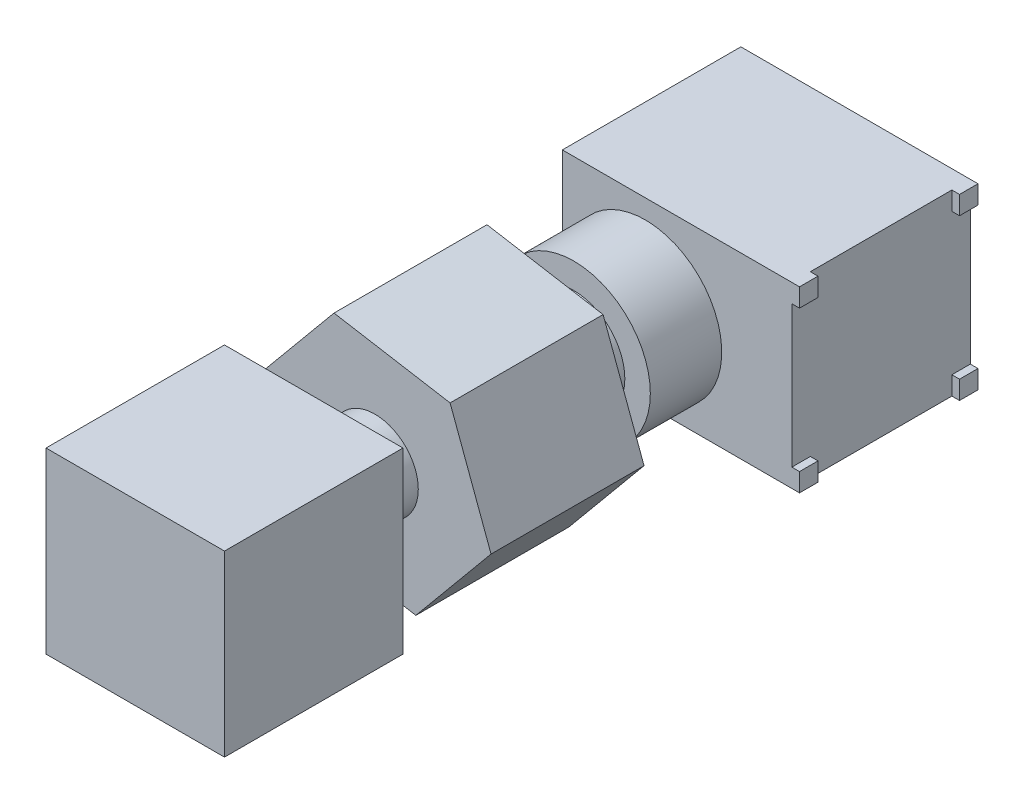
ISO-10303-21;
HEADER;
FILE_DESCRIPTION(('STEP AP214'),'2;1');
FILE_NAME('part.step','',(''),(''),'','','');
FILE_SCHEMA(('AUTOMOTIVE_DESIGN { 1 0 10303 214 1 1 1 1 }'));
ENDSEC;
DATA;
#1=APPLICATION_CONTEXT('core data for automotive mechanical design processes');
#2=APPLICATION_PROTOCOL_DEFINITION('international standard','automotive_design',2000,#1);
#3=PRODUCT_CONTEXT('',#1,'mechanical');
#4=PRODUCT('Part','Part','',(#3));
#5=PRODUCT_RELATED_PRODUCT_CATEGORY('part','',(#4));
#6=PRODUCT_DEFINITION_FORMATION('','',#4);
#7=PRODUCT_DEFINITION_CONTEXT('part definition',#1,'design');
#8=PRODUCT_DEFINITION('design','',#6,#7);
#9=PRODUCT_DEFINITION_SHAPE('','',#8);
#10=(LENGTH_UNIT() NAMED_UNIT(*) SI_UNIT(.MILLI.,.METRE.));
#11=(NAMED_UNIT(*) PLANE_ANGLE_UNIT() SI_UNIT($,.RADIAN.));
#12=(NAMED_UNIT(*) SI_UNIT($,.STERADIAN.) SOLID_ANGLE_UNIT());
#13=UNCERTAINTY_MEASURE_WITH_UNIT(LENGTH_MEASURE(1.E-05),#10,'distance_accuracy_value','');
#14=(GEOMETRIC_REPRESENTATION_CONTEXT(3) GLOBAL_UNCERTAINTY_ASSIGNED_CONTEXT((#13)) GLOBAL_UNIT_ASSIGNED_CONTEXT((#10,
#11,#12)) REPRESENTATION_CONTEXT('',''));
#15=CARTESIAN_POINT('',(0.,0.,0.));
#16=DIRECTION('',(0.,0.,1.));
#17=DIRECTION('',(1.,0.,0.));
#18=AXIS2_PLACEMENT_3D('',#15,#16,#17);
#19=CARTESIAN_POINT('',(0.,0.,14.1));
#20=DIRECTION('',(0.,0.,1.));
#21=DIRECTION('',(1.,0.,0.));
#22=AXIS2_PLACEMENT_3D('',#19,#20,#21);
#23=PLANE('',#22);
#24=DIRECTION('',(-0.34758878852976,0.937647073310856,0.));
#25=VECTOR('',#24,1.);
#26=CARTESIAN_POINT('',(3.30331021574324,2.47495199339549,14.1));
#27=LINE('',#26,#25);
#28=CARTESIAN_POINT('',(3.30331021574324,2.47495199339549,14.1));
#29=VERTEX_POINT('',#28);
#30=CARTESIAN_POINT('',(1.69786637074361,6.80575831484259,14.1));
#31=VERTEX_POINT('',#30);
#32=EDGE_CURVE('E245',#29,#31,#27,.T.);
#33=ORIENTED_EDGE('',*,*,#32,.T.);
#34=DIRECTION('',(-0.985820579536211,0.167802815717999,0.));
#35=VECTOR('',#34,1.);
#36=CARTESIAN_POINT('',(1.69786637074361,6.80575831484259,14.1));
#37=LINE('',#36,#35);
#38=CARTESIAN_POINT('',(-2.85544384499962,7.5808063214471,14.1));
#39=VERTEX_POINT('',#38);
#40=EDGE_CURVE('E248',#31,#39,#37,.T.);
#41=ORIENTED_EDGE('',*,*,#40,.T.);
#42=DIRECTION('',(-0.638231791006451,-0.769844257592857,0.));
#43=VECTOR('',#42,1.);
#44=CARTESIAN_POINT('',(-2.85544384499962,7.5808063214471,14.1));
#45=LINE('',#44,#43);
#46=CARTESIAN_POINT('',(-5.80331021574323,4.02504800660451,14.1));
#47=VERTEX_POINT('',#46);
#48=EDGE_CURVE('E251',#39,#47,#45,.T.);
#49=ORIENTED_EDGE('',*,*,#48,.T.);
#50=DIRECTION('',(0.34758878852976,-0.937647073310856,0.));
#51=VECTOR('',#50,1.);
#52=CARTESIAN_POINT('',(-5.80331021574323,4.02504800660451,14.1));
#53=LINE('',#52,#51);
#54=CARTESIAN_POINT('',(-4.19786637074361,-0.305758314842589,14.1));
#55=VERTEX_POINT('',#54);
#56=EDGE_CURVE('E253',#47,#55,#53,.T.);
#57=ORIENTED_EDGE('',*,*,#56,.T.);
#58=DIRECTION('',(0.985820579536211,-0.167802815717999,0.));
#59=VECTOR('',#58,1.);
#60=CARTESIAN_POINT('',(-4.19786637074361,-0.305758314842589,14.1));
#61=LINE('',#60,#59);
#62=CARTESIAN_POINT('',(0.355443844999625,-1.0808063214471,14.1));
#63=VERTEX_POINT('',#62);
#64=EDGE_CURVE('E255',#55,#63,#61,.T.);
#65=ORIENTED_EDGE('',*,*,#64,.T.);
#66=DIRECTION('',(0.638231791006451,0.769844257592857,0.));
#67=VECTOR('',#66,1.);
#68=CARTESIAN_POINT('',(0.355443844999625,-1.0808063214471,14.1));
#69=LINE('',#68,#67);
#70=EDGE_CURVE('E257',#63,#29,#69,.T.);
#71=ORIENTED_EDGE('',*,*,#70,.T.);
#72=EDGE_LOOP('',(#33,#41,#49,#57,#65,#71));
#73=FACE_BOUND('',#72,.T.);
#74=CARTESIAN_POINT('',(-1.25,3.25,14.1));
#75=DIRECTION('',(0.,0.,1.));
#76=DIRECTION('',(1.,0.,0.));
#77=AXIS2_PLACEMENT_3D('',#74,#75,#76);
#78=CIRCLE('',#77,1.7);
#79=CARTESIAN_POINT('',(0.450000000000003,3.25,14.1));
#80=VERTEX_POINT('',#79);
#81=EDGE_CURVE('E233',#80,#80,#78,.T.);
#82=ORIENTED_EDGE('',*,*,#81,.F.);
#83=EDGE_LOOP('',(#82));
#84=FACE_BOUND('',#83,.T.);
#85=ADVANCED_FACE('F36',(#73,#84),#23,.T.);
#86=CARTESIAN_POINT('',(-1.25,3.25,6.3));
#87=DIRECTION('',(0.,0.,1.));
#88=DIRECTION('',(1.,0.,0.));
#89=AXIS2_PLACEMENT_3D('',#86,#87,#88);
#90=PLANE('',#89);
#91=CARTESIAN_POINT('',(-1.25,3.25,6.3));
#92=DIRECTION('',(0.,0.,1.));
#93=DIRECTION('',(1.,0.,0.));
#94=AXIS2_PLACEMENT_3D('',#91,#92,#93);
#95=CIRCLE('',#94,3.);
#96=CARTESIAN_POINT('',(1.75,3.25,6.3));
#97=VERTEX_POINT('',#96);
#98=EDGE_CURVE('E292',#97,#97,#95,.T.);
#99=ORIENTED_EDGE('',*,*,#98,.T.);
#100=EDGE_LOOP('',(#99));
#101=FACE_BOUND('',#100,.T.);
#102=CARTESIAN_POINT('',(-1.25,3.25,6.3));
#103=DIRECTION('',(0.,0.,1.));
#104=DIRECTION('',(1.,0.,0.));
#105=AXIS2_PLACEMENT_3D('',#102,#103,#104);
#106=CIRCLE('',#105,2.);
#107=CARTESIAN_POINT('',(0.750000000000001,3.25,6.3));
#108=VERTEX_POINT('',#107);
#109=EDGE_CURVE('E288',#108,#108,#106,.T.);
#110=ORIENTED_EDGE('',*,*,#109,.F.);
#111=EDGE_LOOP('',(#110));
#112=FACE_BOUND('',#111,.T.);
#113=ADVANCED_FACE('F495',(#101,#112),#90,.T.);
#114=CARTESIAN_POINT('',(-4.5,7.,3.5));
#115=DIRECTION('',(0.,0.,-1.));
#116=DIRECTION('',(-1.,0.,0.));
#117=AXIS2_PLACEMENT_3D('',#114,#115,#116);
#118=PLANE('',#117);
#119=DIRECTION('',(1.,0.,0.));
#120=VECTOR('',#119,1.);
#121=CARTESIAN_POINT('',(-4.5,0.,3.5));
#122=LINE('',#121,#120);
#123=CARTESIAN_POINT('',(-4.5,0.,3.5));
#124=VERTEX_POINT('',#123);
#125=CARTESIAN_POINT('',(4.8,0.,3.5));
#126=VERTEX_POINT('',#125);
#127=EDGE_CURVE('E418',#124,#126,#122,.T.);
#128=ORIENTED_EDGE('',*,*,#127,.T.);
#129=DIRECTION('',(0.,-1.,0.));
#130=VECTOR('',#129,1.);
#131=CARTESIAN_POINT('',(4.8,0.,3.5));
#132=LINE('',#131,#130);
#133=CARTESIAN_POINT('',(4.8,0.725,3.5));
#134=VERTEX_POINT('',#133);
#135=EDGE_CURVE('E319',#134,#126,#132,.T.);
#136=ORIENTED_EDGE('',*,*,#135,.F.);
#137=DIRECTION('',(-1.,0.,0.));
#138=VECTOR('',#137,1.);
#139=CARTESIAN_POINT('',(4.8,0.725,3.5));
#140=LINE('',#139,#138);
#141=CARTESIAN_POINT('',(4.5,0.725,3.5));
#142=VERTEX_POINT('',#141);
#143=EDGE_CURVE('E329',#134,#142,#140,.T.);
#144=ORIENTED_EDGE('',*,*,#143,.T.);
#145=DIRECTION('',(0.,-1.,0.));
#146=VECTOR('',#145,1.);
#147=CARTESIAN_POINT('',(4.5,7.,3.5));
#148=LINE('',#147,#146);
#149=CARTESIAN_POINT('',(4.5,6.275,3.5));
#150=VERTEX_POINT('',#149);
#151=EDGE_CURVE('E408',#150,#142,#148,.T.);
#152=ORIENTED_EDGE('',*,*,#151,.F.);
#153=DIRECTION('',(-1.,0.,0.));
#154=VECTOR('',#153,1.);
#155=CARTESIAN_POINT('',(4.8,6.275,3.5));
#156=LINE('',#155,#154);
#157=CARTESIAN_POINT('',(4.8,6.275,3.5));
#158=VERTEX_POINT('',#157);
#159=EDGE_CURVE('E393',#158,#150,#156,.T.);
#160=ORIENTED_EDGE('',*,*,#159,.F.);
#161=DIRECTION('',(0.,-1.,0.));
#162=VECTOR('',#161,1.);
#163=CARTESIAN_POINT('',(4.8,7.,3.5));
#164=LINE('',#163,#162);
#165=CARTESIAN_POINT('',(4.8,7.,3.5));
#166=VERTEX_POINT('',#165);
#167=EDGE_CURVE('E364',#166,#158,#164,.T.);
#168=ORIENTED_EDGE('',*,*,#167,.F.);
#169=DIRECTION('',(1.,0.,0.));
#170=VECTOR('',#169,1.);
#171=CARTESIAN_POINT('',(-4.5,7.,3.5));
#172=LINE('',#171,#170);
#173=CARTESIAN_POINT('',(-4.5,7.,3.5));
#174=VERTEX_POINT('',#173);
#175=EDGE_CURVE('E412',#174,#166,#172,.T.);
#176=ORIENTED_EDGE('',*,*,#175,.F.);
#177=DIRECTION('',(0.,-1.,0.));
#178=VECTOR('',#177,1.);
#179=CARTESIAN_POINT('',(-4.5,7.,3.5));
#180=LINE('',#179,#178);
#181=EDGE_CURVE('E411',#174,#124,#180,.T.);
#182=ORIENTED_EDGE('',*,*,#181,.T.);
#183=EDGE_LOOP('',(#128,#136,#144,#152,#160,#168,#176,#182));
#184=FACE_BOUND('',#183,.T.);
#185=CARTESIAN_POINT('',(-1.25,3.25,3.5));
#186=DIRECTION('',(0.,0.,-1.));
#187=DIRECTION('',(-1.,0.,0.));
#188=AXIS2_PLACEMENT_3D('',#185,#186,#187);
#189=CIRCLE('',#188,3.);
#190=CARTESIAN_POINT('',(-4.25,3.25,3.5));
#191=VERTEX_POINT('',#190);
#192=EDGE_CURVE('E11',#191,#191,#189,.F.);
#193=ORIENTED_EDGE('',*,*,#192,.F.);
#194=EDGE_LOOP('',(#193));
#195=FACE_BOUND('',#194,.T.);
#196=ADVANCED_FACE('F467',(#184,#195),#118,.F.);
#197=CARTESIAN_POINT('',(4.5,7.,-3.5));
#198=DIRECTION('',(-1.,0.,0.));
#199=DIRECTION('',(0.,0.,1.));
#200=AXIS2_PLACEMENT_3D('',#197,#198,#199);
#201=PLANE('',#200);
#202=DIRECTION('',(0.,0.,1.));
#203=VECTOR('',#202,1.);
#204=CARTESIAN_POINT('',(4.5,0.725,-3.5));
#205=LINE('',#204,#203);
#206=CARTESIAN_POINT('',(4.5,0.725,-3.5));
#207=VERTEX_POINT('',#206);
#208=CARTESIAN_POINT('',(4.5,0.725,-2.775));
#209=VERTEX_POINT('',#208);
#210=EDGE_CURVE('E55',#207,#209,#205,.T.);
#211=ORIENTED_EDGE('',*,*,#210,.F.);
#212=DIRECTION('',(0.,-1.,0.));
#213=VECTOR('',#212,1.);
#214=CARTESIAN_POINT('',(4.5,7.,-3.5));
#215=LINE('',#214,#213);
#216=CARTESIAN_POINT('',(4.5,6.275,-3.5));
#217=VERTEX_POINT('',#216);
#218=EDGE_CURVE('E44',#217,#207,#215,.T.);
#219=ORIENTED_EDGE('',*,*,#218,.F.);
#220=DIRECTION('',(0.,0.,-1.));
#221=VECTOR('',#220,1.);
#222=CARTESIAN_POINT('',(4.5,6.275,-3.5));
#223=LINE('',#222,#221);
#224=CARTESIAN_POINT('',(4.5,6.275,-2.775));
#225=VERTEX_POINT('',#224);
#226=EDGE_CURVE('E347',#225,#217,#223,.T.);
#227=ORIENTED_EDGE('',*,*,#226,.F.);
#228=DIRECTION('',(0.,-1.,0.));
#229=VECTOR('',#228,1.);
#230=CARTESIAN_POINT('',(4.5,7.,-2.775));
#231=LINE('',#230,#229);
#232=CARTESIAN_POINT('',(4.5,7.,-2.775));
#233=VERTEX_POINT('',#232);
#234=EDGE_CURVE('E342',#233,#225,#231,.T.);
#235=ORIENTED_EDGE('',*,*,#234,.F.);
#236=DIRECTION('',(0.,0.,-1.));
#237=VECTOR('',#236,1.);
#238=CARTESIAN_POINT('',(4.5,7.,-3.5));
#239=LINE('',#238,#237);
#240=CARTESIAN_POINT('',(4.5,7.,2.775));
#241=VERTEX_POINT('',#240);
#242=EDGE_CURVE('E413',#241,#233,#239,.T.);
#243=ORIENTED_EDGE('',*,*,#242,.F.);
#244=DIRECTION('',(0.,1.,0.));
#245=VECTOR('',#244,1.);
#246=CARTESIAN_POINT('',(4.5,7.,2.775));
#247=LINE('',#246,#245);
#248=CARTESIAN_POINT('',(4.5,6.275,2.775));
#249=VERTEX_POINT('',#248);
#250=EDGE_CURVE('E368',#249,#241,#247,.T.);
#251=ORIENTED_EDGE('',*,*,#250,.F.);
#252=DIRECTION('',(0.,0.,-1.));
#253=VECTOR('',#252,1.);
#254=CARTESIAN_POINT('',(4.5,6.275,3.5));
#255=LINE('',#254,#253);
#256=EDGE_CURVE('E363',#150,#249,#255,.T.);
#257=ORIENTED_EDGE('',*,*,#256,.F.);
#258=ORIENTED_EDGE('',*,*,#151,.T.);
#259=DIRECTION('',(0.,0.,1.));
#260=VECTOR('',#259,1.);
#261=CARTESIAN_POINT('',(4.5,0.725,3.5));
#262=LINE('',#261,#260);
#263=CARTESIAN_POINT('',(4.5,0.725,2.775));
#264=VERTEX_POINT('',#263);
#265=EDGE_CURVE('E323',#264,#142,#262,.T.);
#266=ORIENTED_EDGE('',*,*,#265,.F.);
#267=DIRECTION('',(0.,1.,0.));
#268=VECTOR('',#267,1.);
#269=CARTESIAN_POINT('',(4.5,0.,2.775));
#270=LINE('',#269,#268);
#271=CARTESIAN_POINT('',(4.5,0.,2.775));
#272=VERTEX_POINT('',#271);
#273=EDGE_CURVE('E318',#272,#264,#270,.T.);
#274=ORIENTED_EDGE('',*,*,#273,.F.);
#275=DIRECTION('',(0.,0.,-1.));
#276=VECTOR('',#275,1.);
#277=CARTESIAN_POINT('',(4.5,0.,-3.5));
#278=LINE('',#277,#276);
#279=CARTESIAN_POINT('',(4.5,0.,-2.775));
#280=VERTEX_POINT('',#279);
#281=EDGE_CURVE('E398',#272,#280,#278,.T.);
#282=ORIENTED_EDGE('',*,*,#281,.T.);
#283=DIRECTION('',(0.,-1.,0.));
#284=VECTOR('',#283,1.);
#285=CARTESIAN_POINT('',(4.5,0.,-2.775));
#286=LINE('',#285,#284);
#287=EDGE_CURVE('E51',#209,#280,#286,.T.);
#288=ORIENTED_EDGE('',*,*,#287,.F.);
#289=EDGE_LOOP('',(#211,#219,#227,#235,#243,#251,#257,#258,#266,#274,#282,#288));
#290=FACE_BOUND('',#289,.T.);
#291=ADVANCED_FACE('F38',(#290),#201,.F.);
#292=CARTESIAN_POINT('',(-4.5,7.,-3.5));
#293=DIRECTION('',(0.,0.,1.));
#294=DIRECTION('',(1.,0.,0.));
#295=AXIS2_PLACEMENT_3D('',#292,#293,#294);
#296=PLANE('',#295);
#297=DIRECTION('',(-1.,0.,0.));
#298=VECTOR('',#297,1.);
#299=CARTESIAN_POINT('',(-4.5,0.,-3.5));
#300=LINE('',#299,#298);
#301=CARTESIAN_POINT('',(4.8,0.,-3.5));
#302=VERTEX_POINT('',#301);
#303=CARTESIAN_POINT('',(-4.5,0.,-3.5));
#304=VERTEX_POINT('',#303);
#305=EDGE_CURVE('E402',#302,#304,#300,.T.);
#306=ORIENTED_EDGE('',*,*,#305,.T.);
#307=DIRECTION('',(0.,-1.,0.));
#308=VECTOR('',#307,1.);
#309=CARTESIAN_POINT('',(-4.5,7.,-3.5));
#310=LINE('',#309,#308);
#311=CARTESIAN_POINT('',(-4.5,7.,-3.5));
#312=VERTEX_POINT('',#311);
#313=EDGE_CURVE('E422',#312,#304,#310,.T.);
#314=ORIENTED_EDGE('',*,*,#313,.F.);
#315=DIRECTION('',(-1.,0.,0.));
#316=VECTOR('',#315,1.);
#317=CARTESIAN_POINT('',(-4.5,7.,-3.5));
#318=LINE('',#317,#316);
#319=CARTESIAN_POINT('',(4.8,7.,-3.5));
#320=VERTEX_POINT('',#319);
#321=EDGE_CURVE('E454',#320,#312,#318,.T.);
#322=ORIENTED_EDGE('',*,*,#321,.F.);
#323=DIRECTION('',(0.,1.,0.));
#324=VECTOR('',#323,1.);
#325=CARTESIAN_POINT('',(4.8,7.,-3.5));
#326=LINE('',#325,#324);
#327=CARTESIAN_POINT('',(4.8,6.275,-3.5));
#328=VERTEX_POINT('',#327);
#329=EDGE_CURVE('E343',#328,#320,#326,.T.);
#330=ORIENTED_EDGE('',*,*,#329,.F.);
#331=DIRECTION('',(-1.,0.,0.));
#332=VECTOR('',#331,1.);
#333=CARTESIAN_POINT('',(4.8,6.275,-3.5));
#334=LINE('',#333,#332);
#335=EDGE_CURVE('E353',#328,#217,#334,.T.);
#336=ORIENTED_EDGE('',*,*,#335,.T.);
#337=ORIENTED_EDGE('',*,*,#218,.T.);
#338=DIRECTION('',(-1.,0.,0.));
#339=VECTOR('',#338,1.);
#340=CARTESIAN_POINT('',(4.8,0.725,-3.5));
#341=LINE('',#340,#339);
#342=CARTESIAN_POINT('',(4.8,0.725,-3.5));
#343=VERTEX_POINT('',#342);
#344=EDGE_CURVE('E315',#343,#207,#341,.T.);
#345=ORIENTED_EDGE('',*,*,#344,.F.);
#346=DIRECTION('',(0.,1.,0.));
#347=VECTOR('',#346,1.);
#348=CARTESIAN_POINT('',(4.8,0.,-3.5));
#349=LINE('',#348,#347);
#350=EDGE_CURVE('E297',#302,#343,#349,.T.);
#351=ORIENTED_EDGE('',*,*,#350,.F.);
#352=EDGE_LOOP('',(#306,#314,#322,#330,#336,#337,#345,#351));
#353=FACE_BOUND('',#352,.T.);
#354=ADVANCED_FACE('F426',(#353),#296,.F.);
#355=CARTESIAN_POINT('',(-4.5,7.,-3.5));
#356=DIRECTION('',(1.,0.,0.));
#357=DIRECTION('',(0.,0.,-1.));
#358=AXIS2_PLACEMENT_3D('',#355,#356,#357);
#359=PLANE('',#358);
#360=DIRECTION('',(0.,0.,1.));
#361=VECTOR('',#360,1.);
#362=CARTESIAN_POINT('',(-4.5,0.,-3.5));
#363=LINE('',#362,#361);
#364=EDGE_CURVE('E442',#304,#124,#363,.T.);
#365=ORIENTED_EDGE('',*,*,#364,.T.);
#366=ORIENTED_EDGE('',*,*,#181,.F.);
#367=DIRECTION('',(0.,0.,1.));
#368=VECTOR('',#367,1.);
#369=CARTESIAN_POINT('',(-4.5,7.,-3.5));
#370=LINE('',#369,#368);
#371=EDGE_CURVE('E447',#312,#174,#370,.T.);
#372=ORIENTED_EDGE('',*,*,#371,.F.);
#373=ORIENTED_EDGE('',*,*,#313,.T.);
#374=EDGE_LOOP('',(#365,#366,#372,#373));
#375=FACE_BOUND('',#374,.T.);
#376=ADVANCED_FACE('F445',(#375),#359,.F.);
#377=CARTESIAN_POINT('',(0.,7.,0.));
#378=DIRECTION('',(0.,1.,0.));
#379=DIRECTION('',(0.,0.,1.));
#380=AXIS2_PLACEMENT_3D('',#377,#378,#379);
#381=PLANE('',#380);
#382=ORIENTED_EDGE('',*,*,#175,.T.);
#383=DIRECTION('',(0.,0.,1.));
#384=VECTOR('',#383,1.);
#385=CARTESIAN_POINT('',(4.8,7.,3.5));
#386=LINE('',#385,#384);
#387=CARTESIAN_POINT('',(4.8,7.,2.775));
#388=VERTEX_POINT('',#387);
#389=EDGE_CURVE('E372',#388,#166,#386,.T.);
#390=ORIENTED_EDGE('',*,*,#389,.F.);
#391=DIRECTION('',(-1.,0.,0.));
#392=VECTOR('',#391,1.);
#393=CARTESIAN_POINT('',(4.8,7.,2.775));
#394=LINE('',#393,#392);
#395=EDGE_CURVE('E375',#388,#241,#394,.T.);
#396=ORIENTED_EDGE('',*,*,#395,.T.);
#397=ORIENTED_EDGE('',*,*,#242,.T.);
#398=DIRECTION('',(-1.,0.,0.));
#399=VECTOR('',#398,1.);
#400=CARTESIAN_POINT('',(4.8,7.,-2.775));
#401=LINE('',#400,#399);
#402=CARTESIAN_POINT('',(4.8,7.,-2.775));
#403=VERTEX_POINT('',#402);
#404=EDGE_CURVE('E361',#403,#233,#401,.T.);
#405=ORIENTED_EDGE('',*,*,#404,.F.);
#406=DIRECTION('',(0.,0.,1.));
#407=VECTOR('',#406,1.);
#408=CARTESIAN_POINT('',(4.8,7.,-3.5));
#409=LINE('',#408,#407);
#410=EDGE_CURVE('E346',#320,#403,#409,.T.);
#411=ORIENTED_EDGE('',*,*,#410,.F.);
#412=ORIENTED_EDGE('',*,*,#321,.T.);
#413=ORIENTED_EDGE('',*,*,#371,.T.);
#414=EDGE_LOOP('',(#382,#390,#396,#397,#405,#411,#412,#413));
#415=FACE_BOUND('',#414,.T.);
#416=ADVANCED_FACE('F458',(#415),#381,.T.);
#417=CARTESIAN_POINT('',(0.,0.,0.));
#418=DIRECTION('',(0.,1.,0.));
#419=DIRECTION('',(0.,0.,1.));
#420=AXIS2_PLACEMENT_3D('',#417,#418,#419);
#421=PLANE('',#420);
#422=ORIENTED_EDGE('',*,*,#281,.F.);
#423=DIRECTION('',(-1.,0.,0.));
#424=VECTOR('',#423,1.);
#425=CARTESIAN_POINT('',(4.8,0.,2.775));
#426=LINE('',#425,#424);
#427=CARTESIAN_POINT('',(4.8,0.,2.775));
#428=VERTEX_POINT('',#427);
#429=EDGE_CURVE('E339',#428,#272,#426,.T.);
#430=ORIENTED_EDGE('',*,*,#429,.F.);
#431=DIRECTION('',(0.,0.,-1.));
#432=VECTOR('',#431,1.);
#433=CARTESIAN_POINT('',(4.8,0.,3.5));
#434=LINE('',#433,#432);
#435=EDGE_CURVE('E322',#126,#428,#434,.T.);
#436=ORIENTED_EDGE('',*,*,#435,.F.);
#437=ORIENTED_EDGE('',*,*,#127,.F.);
#438=ORIENTED_EDGE('',*,*,#364,.F.);
#439=ORIENTED_EDGE('',*,*,#305,.F.);
#440=DIRECTION('',(0.,0.,-1.));
#441=VECTOR('',#440,1.);
#442=CARTESIAN_POINT('',(4.8,0.,-3.5));
#443=LINE('',#442,#441);
#444=CARTESIAN_POINT('',(4.8,0.,-2.775));
#445=VERTEX_POINT('',#444);
#446=EDGE_CURVE('E304',#445,#302,#443,.T.);
#447=ORIENTED_EDGE('',*,*,#446,.F.);
#448=DIRECTION('',(-1.,0.,0.));
#449=VECTOR('',#448,1.);
#450=CARTESIAN_POINT('',(4.8,0.,-2.775));
#451=LINE('',#450,#449);
#452=EDGE_CURVE('E307',#445,#280,#451,.T.);
#453=ORIENTED_EDGE('',*,*,#452,.T.);
#454=EDGE_LOOP('',(#422,#430,#436,#437,#438,#439,#447,#453));
#455=FACE_BOUND('',#454,.T.);
#456=ADVANCED_FACE('F449',(#455),#421,.F.);
#457=CARTESIAN_POINT('',(4.8,6.275,3.5));
#458=DIRECTION('',(0.,1.,0.));
#459=DIRECTION('',(0.,0.,1.));
#460=AXIS2_PLACEMENT_3D('',#457,#458,#459);
#461=PLANE('',#460);
#462=ORIENTED_EDGE('',*,*,#256,.T.);
#463=DIRECTION('',(-1.,0.,0.));
#464=VECTOR('',#463,1.);
#465=CARTESIAN_POINT('',(4.8,6.275,2.775));
#466=LINE('',#465,#464);
#467=CARTESIAN_POINT('',(4.8,6.275,2.775));
#468=VERTEX_POINT('',#467);
#469=EDGE_CURVE('E378',#468,#249,#466,.T.);
#470=ORIENTED_EDGE('',*,*,#469,.F.);
#471=DIRECTION('',(0.,0.,-1.));
#472=VECTOR('',#471,1.);
#473=CARTESIAN_POINT('',(4.8,6.275,3.5));
#474=LINE('',#473,#472);
#475=EDGE_CURVE('E367',#158,#468,#474,.T.);
#476=ORIENTED_EDGE('',*,*,#475,.F.);
#477=ORIENTED_EDGE('',*,*,#159,.T.);
#478=EDGE_LOOP('',(#462,#470,#476,#477));
#479=FACE_BOUND('',#478,.T.);
#480=ADVANCED_FACE('F576',(#479),#461,.F.);
#481=CARTESIAN_POINT('',(4.8,7.,2.775));
#482=DIRECTION('',(0.,0.,1.));
#483=DIRECTION('',(1.,0.,0.));
#484=AXIS2_PLACEMENT_3D('',#481,#482,#483);
#485=PLANE('',#484);
#486=ORIENTED_EDGE('',*,*,#250,.T.);
#487=ORIENTED_EDGE('',*,*,#395,.F.);
#488=DIRECTION('',(0.,1.,0.));
#489=VECTOR('',#488,1.);
#490=CARTESIAN_POINT('',(4.8,7.,2.775));
#491=LINE('',#490,#489);
#492=EDGE_CURVE('E370',#468,#388,#491,.T.);
#493=ORIENTED_EDGE('',*,*,#492,.F.);
#494=ORIENTED_EDGE('',*,*,#469,.T.);
#495=EDGE_LOOP('',(#486,#487,#493,#494));
#496=FACE_BOUND('',#495,.T.);
#497=ADVANCED_FACE('F461',(#496),#485,.F.);
#498=CARTESIAN_POINT('',(4.8,0.,0.));
#499=DIRECTION('',(1.,0.,0.));
#500=DIRECTION('',(0.,0.,-1.));
#501=AXIS2_PLACEMENT_3D('',#498,#499,#500);
#502=PLANE('',#501);
#503=ORIENTED_EDGE('',*,*,#167,.T.);
#504=ORIENTED_EDGE('',*,*,#475,.T.);
#505=ORIENTED_EDGE('',*,*,#492,.T.);
#506=ORIENTED_EDGE('',*,*,#389,.T.);
#507=EDGE_LOOP('',(#503,#504,#505,#506));
#508=FACE_BOUND('',#507,.T.);
#509=ADVANCED_FACE('F465',(#508),#502,.T.);
#510=CARTESIAN_POINT('',(4.8,7.,-2.775));
#511=DIRECTION('',(0.,0.,-1.));
#512=DIRECTION('',(-1.,0.,0.));
#513=AXIS2_PLACEMENT_3D('',#510,#511,#512);
#514=PLANE('',#513);
#515=ORIENTED_EDGE('',*,*,#234,.T.);
#516=DIRECTION('',(-1.,0.,0.));
#517=VECTOR('',#516,1.);
#518=CARTESIAN_POINT('',(4.8,6.275,-2.775));
#519=LINE('',#518,#517);
#520=CARTESIAN_POINT('',(4.8,6.275,-2.775));
#521=VERTEX_POINT('',#520);
#522=EDGE_CURVE('E358',#521,#225,#519,.T.);
#523=ORIENTED_EDGE('',*,*,#522,.F.);
#524=DIRECTION('',(0.,-1.,0.));
#525=VECTOR('',#524,1.);
#526=CARTESIAN_POINT('',(4.8,7.,-2.775));
#527=LINE('',#526,#525);
#528=EDGE_CURVE('E349',#403,#521,#527,.T.);
#529=ORIENTED_EDGE('',*,*,#528,.F.);
#530=ORIENTED_EDGE('',*,*,#404,.T.);
#531=EDGE_LOOP('',(#515,#523,#529,#530));
#532=FACE_BOUND('',#531,.T.);
#533=ADVANCED_FACE('F594',(#532),#514,.F.);
#534=CARTESIAN_POINT('',(4.8,6.275,-3.5));
#535=DIRECTION('',(0.,1.,0.));
#536=DIRECTION('',(0.,0.,1.));
#537=AXIS2_PLACEMENT_3D('',#534,#535,#536);
#538=PLANE('',#537);
#539=ORIENTED_EDGE('',*,*,#226,.T.);
#540=ORIENTED_EDGE('',*,*,#335,.F.);
#541=DIRECTION('',(0.,0.,-1.));
#542=VECTOR('',#541,1.);
#543=CARTESIAN_POINT('',(4.8,6.275,-3.5));
#544=LINE('',#543,#542);
#545=EDGE_CURVE('E351',#521,#328,#544,.T.);
#546=ORIENTED_EDGE('',*,*,#545,.F.);
#547=ORIENTED_EDGE('',*,*,#522,.T.);
#548=EDGE_LOOP('',(#539,#540,#546,#547));
#549=FACE_BOUND('',#548,.T.);
#550=ADVANCED_FACE('F601',(#549),#538,.F.);
#551=CARTESIAN_POINT('',(4.8,0.,0.));
#552=DIRECTION('',(-1.,0.,0.));
#553=DIRECTION('',(0.,0.,1.));
#554=AXIS2_PLACEMENT_3D('',#551,#552,#553);
#555=PLANE('',#554);
#556=ORIENTED_EDGE('',*,*,#329,.T.);
#557=ORIENTED_EDGE('',*,*,#410,.T.);
#558=ORIENTED_EDGE('',*,*,#528,.T.);
#559=ORIENTED_EDGE('',*,*,#545,.T.);
#560=EDGE_LOOP('',(#556,#557,#558,#559));
#561=FACE_BOUND('',#560,.T.);
#562=ADVANCED_FACE('F609',(#561),#555,.F.);
#563=CARTESIAN_POINT('',(4.8,0.,2.775));
#564=DIRECTION('',(0.,0.,1.));
#565=DIRECTION('',(1.,0.,0.));
#566=AXIS2_PLACEMENT_3D('',#563,#564,#565);
#567=PLANE('',#566);
#568=ORIENTED_EDGE('',*,*,#273,.T.);
#569=DIRECTION('',(-1.,0.,0.));
#570=VECTOR('',#569,1.);
#571=CARTESIAN_POINT('',(4.8,0.725,2.775));
#572=LINE('',#571,#570);
#573=CARTESIAN_POINT('',(4.8,0.725,2.775));
#574=VERTEX_POINT('',#573);
#575=EDGE_CURVE('E336',#574,#264,#572,.T.);
#576=ORIENTED_EDGE('',*,*,#575,.F.);
#577=DIRECTION('',(0.,1.,0.));
#578=VECTOR('',#577,1.);
#579=CARTESIAN_POINT('',(4.8,0.,2.775));
#580=LINE('',#579,#578);
#581=EDGE_CURVE('E325',#428,#574,#580,.T.);
#582=ORIENTED_EDGE('',*,*,#581,.F.);
#583=ORIENTED_EDGE('',*,*,#429,.T.);
#584=EDGE_LOOP('',(#568,#576,#582,#583));
#585=FACE_BOUND('',#584,.T.);
#586=ADVANCED_FACE('F479',(#585),#567,.F.);
#587=CARTESIAN_POINT('',(4.8,0.725,3.5));
#588=DIRECTION('',(0.,-1.,0.));
#589=DIRECTION('',(0.,0.,-1.));
#590=AXIS2_PLACEMENT_3D('',#587,#588,#589);
#591=PLANE('',#590);
#592=ORIENTED_EDGE('',*,*,#265,.T.);
#593=ORIENTED_EDGE('',*,*,#143,.F.);
#594=DIRECTION('',(0.,0.,1.));
#595=VECTOR('',#594,1.);
#596=CARTESIAN_POINT('',(4.8,0.725,3.5));
#597=LINE('',#596,#595);
#598=EDGE_CURVE('E327',#574,#134,#597,.T.);
#599=ORIENTED_EDGE('',*,*,#598,.F.);
#600=ORIENTED_EDGE('',*,*,#575,.T.);
#601=EDGE_LOOP('',(#592,#593,#599,#600));
#602=FACE_BOUND('',#601,.T.);
#603=ADVANCED_FACE('F474',(#602),#591,.F.);
#604=CARTESIAN_POINT('',(4.8,0.,0.));
#605=DIRECTION('',(-1.,0.,0.));
#606=DIRECTION('',(0.,0.,1.));
#607=AXIS2_PLACEMENT_3D('',#604,#605,#606);
#608=PLANE('',#607);
#609=ORIENTED_EDGE('',*,*,#135,.T.);
#610=ORIENTED_EDGE('',*,*,#435,.T.);
#611=ORIENTED_EDGE('',*,*,#581,.T.);
#612=ORIENTED_EDGE('',*,*,#598,.T.);
#613=EDGE_LOOP('',(#609,#610,#611,#612));
#614=FACE_BOUND('',#613,.T.);
#615=ADVANCED_FACE('F492',(#614),#608,.F.);
#616=CARTESIAN_POINT('',(4.8,0.725,-3.5));
#617=DIRECTION('',(0.,-1.,0.));
#618=DIRECTION('',(0.,0.,-1.));
#619=AXIS2_PLACEMENT_3D('',#616,#617,#618);
#620=PLANE('',#619);
#621=ORIENTED_EDGE('',*,*,#210,.T.);
#622=DIRECTION('',(-1.,0.,0.));
#623=VECTOR('',#622,1.);
#624=CARTESIAN_POINT('',(4.8,0.725,-2.775));
#625=LINE('',#624,#623);
#626=CARTESIAN_POINT('',(4.8,0.725,-2.775));
#627=VERTEX_POINT('',#626);
#628=EDGE_CURVE('E312',#627,#209,#625,.T.);
#629=ORIENTED_EDGE('',*,*,#628,.F.);
#630=DIRECTION('',(0.,0.,1.));
#631=VECTOR('',#630,1.);
#632=CARTESIAN_POINT('',(4.8,0.725,-3.5));
#633=LINE('',#632,#631);
#634=EDGE_CURVE('E300',#343,#627,#633,.T.);
#635=ORIENTED_EDGE('',*,*,#634,.F.);
#636=ORIENTED_EDGE('',*,*,#344,.T.);
#637=EDGE_LOOP('',(#621,#629,#635,#636));
#638=FACE_BOUND('',#637,.T.);
#639=ADVANCED_FACE('F432',(#638),#620,.F.);
#640=CARTESIAN_POINT('',(4.8,0.,-2.775));
#641=DIRECTION('',(0.,0.,-1.));
#642=DIRECTION('',(-1.,0.,0.));
#643=AXIS2_PLACEMENT_3D('',#640,#641,#642);
#644=PLANE('',#643);
#645=ORIENTED_EDGE('',*,*,#287,.T.);
#646=ORIENTED_EDGE('',*,*,#452,.F.);
#647=DIRECTION('',(0.,-1.,0.));
#648=VECTOR('',#647,1.);
#649=CARTESIAN_POINT('',(4.8,0.,-2.775));
#650=LINE('',#649,#648);
#651=EDGE_CURVE('E302',#627,#445,#650,.T.);
#652=ORIENTED_EDGE('',*,*,#651,.F.);
#653=ORIENTED_EDGE('',*,*,#628,.T.);
#654=EDGE_LOOP('',(#645,#646,#652,#653));
#655=FACE_BOUND('',#654,.T.);
#656=ADVANCED_FACE('F483',(#655),#644,.F.);
#657=CARTESIAN_POINT('',(4.8,0.,0.));
#658=DIRECTION('',(1.,0.,0.));
#659=DIRECTION('',(0.,0.,-1.));
#660=AXIS2_PLACEMENT_3D('',#657,#658,#659);
#661=PLANE('',#660);
#662=ORIENTED_EDGE('',*,*,#350,.T.);
#663=ORIENTED_EDGE('',*,*,#634,.T.);
#664=ORIENTED_EDGE('',*,*,#651,.T.);
#665=ORIENTED_EDGE('',*,*,#446,.T.);
#666=EDGE_LOOP('',(#662,#663,#664,#665));
#667=FACE_BOUND('',#666,.T.);
#668=ADVANCED_FACE('F436',(#667),#661,.T.);
#669=CARTESIAN_POINT('',(-1.25,3.25,6.3));
#670=DIRECTION('',(0.,0.,-1.));
#671=DIRECTION('',(-1.,0.,0.));
#672=AXIS2_PLACEMENT_3D('',#669,#670,#671);
#673=CYLINDRICAL_SURFACE('',#672,3.);
#674=ORIENTED_EDGE('',*,*,#98,.F.);
#675=EDGE_LOOP('',(#674));
#676=FACE_BOUND('',#675,.T.);
#677=ORIENTED_EDGE('',*,*,#192,.T.);
#678=EDGE_LOOP('',(#677));
#679=FACE_BOUND('',#678,.T.);
#680=ADVANCED_FACE('F490',(#676,#679),#673,.T.);
#681=CARTESIAN_POINT('',(-1.25,3.25,8.1));
#682=DIRECTION('',(0.,0.,-1.));
#683=DIRECTION('',(-1.,0.,0.));
#684=AXIS2_PLACEMENT_3D('',#681,#682,#683);
#685=CYLINDRICAL_SURFACE('',#684,2.);
#686=CARTESIAN_POINT('',(-1.25,3.25,8.1));
#687=DIRECTION('',(0.,0.,1.));
#688=DIRECTION('',(1.,0.,0.));
#689=AXIS2_PLACEMENT_3D('',#686,#687,#688);
#690=CIRCLE('',#689,2.);
#691=CARTESIAN_POINT('',(0.750000000000001,3.25,8.1));
#692=VERTEX_POINT('',#691);
#693=EDGE_CURVE('E289',#692,#692,#690,.T.);
#694=ORIENTED_EDGE('',*,*,#693,.F.);
#695=EDGE_LOOP('',(#694));
#696=FACE_BOUND('',#695,.T.);
#697=ORIENTED_EDGE('',*,*,#109,.T.);
#698=EDGE_LOOP('',(#697));
#699=FACE_BOUND('',#698,.T.);
#700=ADVANCED_FACE('F512',(#696,#699),#685,.T.);
#701=CARTESIAN_POINT('',(0.,0.,8.1));
#702=DIRECTION('',(0.,0.,1.));
#703=DIRECTION('',(1.,0.,0.));
#704=AXIS2_PLACEMENT_3D('',#701,#702,#703);
#705=PLANE('',#704);
#706=DIRECTION('',(-0.34758878852976,0.937647073310856,0.));
#707=VECTOR('',#706,1.);
#708=CARTESIAN_POINT('',(3.30331021574324,2.47495199339549,8.1));
#709=LINE('',#708,#707);
#710=CARTESIAN_POINT('',(3.30331021574324,2.47495199339549,8.1));
#711=VERTEX_POINT('',#710);
#712=CARTESIAN_POINT('',(1.69786637074361,6.80575831484259,8.1));
#713=VERTEX_POINT('',#712);
#714=EDGE_CURVE('E243',#711,#713,#709,.T.);
#715=ORIENTED_EDGE('',*,*,#714,.F.);
#716=DIRECTION('',(0.638231791006451,0.769844257592857,0.));
#717=VECTOR('',#716,1.);
#718=CARTESIAN_POINT('',(0.355443844999625,-1.0808063214471,8.1));
#719=LINE('',#718,#717);
#720=CARTESIAN_POINT('',(0.355443844999625,-1.0808063214471,8.1));
#721=VERTEX_POINT('',#720);
#722=EDGE_CURVE('E249',#721,#711,#719,.T.);
#723=ORIENTED_EDGE('',*,*,#722,.F.);
#724=DIRECTION('',(0.985820579536211,-0.167802815717999,0.));
#725=VECTOR('',#724,1.);
#726=CARTESIAN_POINT('',(-4.19786637074361,-0.305758314842589,8.1));
#727=LINE('',#726,#725);
#728=CARTESIAN_POINT('',(-4.19786637074361,-0.305758314842589,8.1));
#729=VERTEX_POINT('',#728);
#730=EDGE_CURVE('E268',#729,#721,#727,.T.);
#731=ORIENTED_EDGE('',*,*,#730,.F.);
#732=DIRECTION('',(0.34758878852976,-0.937647073310856,0.));
#733=VECTOR('',#732,1.);
#734=CARTESIAN_POINT('',(-5.80331021574323,4.02504800660451,8.1));
#735=LINE('',#734,#733);
#736=CARTESIAN_POINT('',(-5.80331021574323,4.02504800660451,8.1));
#737=VERTEX_POINT('',#736);
#738=EDGE_CURVE('E266',#737,#729,#735,.T.);
#739=ORIENTED_EDGE('',*,*,#738,.F.);
#740=DIRECTION('',(-0.638231791006451,-0.769844257592857,0.));
#741=VECTOR('',#740,1.);
#742=CARTESIAN_POINT('',(-2.85544384499962,7.5808063214471,8.1));
#743=LINE('',#742,#741);
#744=CARTESIAN_POINT('',(-2.85544384499962,7.5808063214471,8.1));
#745=VERTEX_POINT('',#744);
#746=EDGE_CURVE('E264',#745,#737,#743,.T.);
#747=ORIENTED_EDGE('',*,*,#746,.F.);
#748=DIRECTION('',(-0.985820579536211,0.167802815717999,0.));
#749=VECTOR('',#748,1.);
#750=CARTESIAN_POINT('',(1.69786637074361,6.80575831484259,8.1));
#751=LINE('',#750,#749);
#752=EDGE_CURVE('E262',#713,#745,#751,.T.);
#753=ORIENTED_EDGE('',*,*,#752,.F.);
#754=EDGE_LOOP('',(#715,#723,#731,#739,#747,#753));
#755=FACE_BOUND('',#754,.T.);
#756=ORIENTED_EDGE('',*,*,#693,.T.);
#757=EDGE_LOOP('',(#756));
#758=FACE_BOUND('',#757,.T.);
#759=ADVANCED_FACE('F508',(#755,#758),#705,.F.);
#760=CARTESIAN_POINT('',(3.30331021574324,2.47495199339549,14.1));
#761=DIRECTION('',(-0.937647073310856,-0.34758878852976,0.));
#762=DIRECTION('',(0.34758878852976,-0.937647073310856,0.));
#763=AXIS2_PLACEMENT_3D('',#760,#761,#762);
#764=PLANE('',#763);
#765=ORIENTED_EDGE('',*,*,#714,.T.);
#766=DIRECTION('',(0.,0.,-1.));
#767=VECTOR('',#766,1.);
#768=CARTESIAN_POINT('',(1.69786637074361,6.80575831484259,14.1));
#769=LINE('',#768,#767);
#770=EDGE_CURVE('E285',#31,#713,#769,.T.);
#771=ORIENTED_EDGE('',*,*,#770,.F.);
#772=ORIENTED_EDGE('',*,*,#32,.F.);
#773=DIRECTION('',(0.,0.,-1.));
#774=VECTOR('',#773,1.);
#775=CARTESIAN_POINT('',(3.30331021574324,2.47495199339549,14.1));
#776=LINE('',#775,#774);
#777=EDGE_CURVE('E259',#29,#711,#776,.T.);
#778=ORIENTED_EDGE('',*,*,#777,.T.);
#779=EDGE_LOOP('',(#765,#771,#772,#778));
#780=FACE_BOUND('',#779,.T.);
#781=ADVANCED_FACE('F511',(#780),#764,.F.);
#782=CARTESIAN_POINT('',(1.69786637074361,6.80575831484259,14.1));
#783=DIRECTION('',(-0.167802815717999,-0.985820579536211,0.));
#784=DIRECTION('',(0.985820579536211,-0.167802815717999,0.));
#785=AXIS2_PLACEMENT_3D('',#782,#783,#784);
#786=PLANE('',#785);
#787=ORIENTED_EDGE('',*,*,#752,.T.);
#788=DIRECTION('',(0.,0.,-1.));
#789=VECTOR('',#788,1.);
#790=CARTESIAN_POINT('',(-2.85544384499962,7.5808063214471,14.1));
#791=LINE('',#790,#789);
#792=EDGE_CURVE('E282',#39,#745,#791,.T.);
#793=ORIENTED_EDGE('',*,*,#792,.F.);
#794=ORIENTED_EDGE('',*,*,#40,.F.);
#795=ORIENTED_EDGE('',*,*,#770,.T.);
#796=EDGE_LOOP('',(#787,#793,#794,#795));
#797=FACE_BOUND('',#796,.T.);
#798=ADVANCED_FACE('F529',(#797),#786,.F.);
#799=CARTESIAN_POINT('',(-2.85544384499962,7.5808063214471,14.1));
#800=DIRECTION('',(0.769844257592857,-0.638231791006451,0.));
#801=DIRECTION('',(0.638231791006451,0.769844257592857,0.));
#802=AXIS2_PLACEMENT_3D('',#799,#800,#801);
#803=PLANE('',#802);
#804=ORIENTED_EDGE('',*,*,#746,.T.);
#805=DIRECTION('',(0.,0.,-1.));
#806=VECTOR('',#805,1.);
#807=CARTESIAN_POINT('',(-5.80331021574323,4.02504800660451,14.1));
#808=LINE('',#807,#806);
#809=EDGE_CURVE('E279',#47,#737,#808,.T.);
#810=ORIENTED_EDGE('',*,*,#809,.F.);
#811=ORIENTED_EDGE('',*,*,#48,.F.);
#812=ORIENTED_EDGE('',*,*,#792,.T.);
#813=EDGE_LOOP('',(#804,#810,#811,#812));
#814=FACE_BOUND('',#813,.T.);
#815=ADVANCED_FACE('F525',(#814),#803,.F.);
#816=CARTESIAN_POINT('',(-5.80331021574323,4.02504800660451,14.1));
#817=DIRECTION('',(0.937647073310856,0.34758878852976,0.));
#818=DIRECTION('',(-0.34758878852976,0.937647073310856,0.));
#819=AXIS2_PLACEMENT_3D('',#816,#817,#818);
#820=PLANE('',#819);
#821=ORIENTED_EDGE('',*,*,#738,.T.);
#822=DIRECTION('',(0.,0.,-1.));
#823=VECTOR('',#822,1.);
#824=CARTESIAN_POINT('',(-4.19786637074361,-0.305758314842589,14.1));
#825=LINE('',#824,#823);
#826=EDGE_CURVE('E276',#55,#729,#825,.T.);
#827=ORIENTED_EDGE('',*,*,#826,.F.);
#828=ORIENTED_EDGE('',*,*,#56,.F.);
#829=ORIENTED_EDGE('',*,*,#809,.T.);
#830=EDGE_LOOP('',(#821,#827,#828,#829));
#831=FACE_BOUND('',#830,.T.);
#832=ADVANCED_FACE('F521',(#831),#820,.F.);
#833=CARTESIAN_POINT('',(-4.19786637074361,-0.305758314842589,14.1));
#834=DIRECTION('',(0.167802815717999,0.985820579536211,0.));
#835=DIRECTION('',(-0.985820579536211,0.167802815717999,0.));
#836=AXIS2_PLACEMENT_3D('',#833,#834,#835);
#837=PLANE('',#836);
#838=ORIENTED_EDGE('',*,*,#730,.T.);
#839=DIRECTION('',(0.,0.,-1.));
#840=VECTOR('',#839,1.);
#841=CARTESIAN_POINT('',(0.355443844999625,-1.0808063214471,14.1));
#842=LINE('',#841,#840);
#843=EDGE_CURVE('E273',#63,#721,#842,.T.);
#844=ORIENTED_EDGE('',*,*,#843,.F.);
#845=ORIENTED_EDGE('',*,*,#64,.F.);
#846=ORIENTED_EDGE('',*,*,#826,.T.);
#847=EDGE_LOOP('',(#838,#844,#845,#846));
#848=FACE_BOUND('',#847,.T.);
#849=ADVANCED_FACE('F517',(#848),#837,.F.);
#850=CARTESIAN_POINT('',(0.355443844999625,-1.0808063214471,14.1));
#851=DIRECTION('',(-0.769844257592857,0.638231791006451,0.));
#852=DIRECTION('',(-0.638231791006451,-0.769844257592857,0.));
#853=AXIS2_PLACEMENT_3D('',#850,#851,#852);
#854=PLANE('',#853);
#855=ORIENTED_EDGE('',*,*,#722,.T.);
#856=ORIENTED_EDGE('',*,*,#777,.F.);
#857=ORIENTED_EDGE('',*,*,#70,.F.);
#858=ORIENTED_EDGE('',*,*,#843,.T.);
#859=EDGE_LOOP('',(#855,#856,#857,#858));
#860=FACE_BOUND('',#859,.T.);
#861=ADVANCED_FACE('F514',(#860),#854,.F.);
#862=CARTESIAN_POINT('',(-1.25,3.25,16.5));
#863=DIRECTION('',(0.,0.,-1.));
#864=DIRECTION('',(-1.,0.,0.));
#865=AXIS2_PLACEMENT_3D('',#862,#863,#864);
#866=CYLINDRICAL_SURFACE('',#865,1.7);
#867=CARTESIAN_POINT('',(-1.25,3.25,16.5));
#868=DIRECTION('',(0.,0.,1.));
#869=DIRECTION('',(1.,0.,0.));
#870=AXIS2_PLACEMENT_3D('',#867,#868,#869);
#871=CIRCLE('',#870,1.7);
#872=CARTESIAN_POINT('',(0.450000000000003,3.25,16.5));
#873=VERTEX_POINT('',#872);
#874=EDGE_CURVE('E236',#873,#873,#871,.T.);
#875=ORIENTED_EDGE('',*,*,#874,.F.);
#876=EDGE_LOOP('',(#875));
#877=FACE_BOUND('',#876,.T.);
#878=ORIENTED_EDGE('',*,*,#81,.T.);
#879=EDGE_LOOP('',(#878));
#880=FACE_BOUND('',#879,.T.);
#881=ADVANCED_FACE('F506',(#877,#880),#866,.T.);
#882=CARTESIAN_POINT('',(0.,0.,16.5));
#883=DIRECTION('',(0.,0.,-1.));
#884=DIRECTION('',(-1.,0.,0.));
#885=AXIS2_PLACEMENT_3D('',#882,#883,#884);
#886=PLANE('',#885);
#887=DIRECTION('',(0.,1.,0.));
#888=VECTOR('',#887,1.);
#889=CARTESIAN_POINT('',(2.25,-0.250000000000001,16.5));
#890=LINE('',#889,#888);
#891=CARTESIAN_POINT('',(2.25,-0.250000000000001,16.5));
#892=VERTEX_POINT('',#891);
#893=CARTESIAN_POINT('',(2.25,6.75,16.5));
#894=VERTEX_POINT('',#893);
#895=EDGE_CURVE('E232',#892,#894,#890,.T.);
#896=ORIENTED_EDGE('',*,*,#895,.F.);
#897=DIRECTION('',(1.,0.,0.));
#898=VECTOR('',#897,1.);
#899=CARTESIAN_POINT('',(-4.75,-0.250000000000001,16.5));
#900=LINE('',#899,#898);
#901=CARTESIAN_POINT('',(-4.75,-0.250000000000001,16.5));
#902=VERTEX_POINT('',#901);
#903=EDGE_CURVE('E228',#902,#892,#900,.T.);
#904=ORIENTED_EDGE('',*,*,#903,.F.);
#905=DIRECTION('',(0.,-1.,0.));
#906=VECTOR('',#905,1.);
#907=CARTESIAN_POINT('',(-4.75,-0.250000000000001,16.5));
#908=LINE('',#907,#906);
#909=CARTESIAN_POINT('',(-4.75,6.75,16.5));
#910=VERTEX_POINT('',#909);
#911=EDGE_CURVE('E789',#910,#902,#908,.T.);
#912=ORIENTED_EDGE('',*,*,#911,.F.);
#913=DIRECTION('',(-1.,0.,0.));
#914=VECTOR('',#913,1.);
#915=CARTESIAN_POINT('',(-4.75,6.75,16.5));
#916=LINE('',#915,#914);
#917=EDGE_CURVE('E793',#894,#910,#916,.T.);
#918=ORIENTED_EDGE('',*,*,#917,.F.);
#919=EDGE_LOOP('',(#896,#904,#912,#918));
#920=FACE_BOUND('',#919,.T.);
#921=ORIENTED_EDGE('',*,*,#874,.T.);
#922=EDGE_LOOP('',(#921));
#923=FACE_BOUND('',#922,.T.);
#924=ADVANCED_FACE('F728',(#920,#923),#886,.T.);
#925=CARTESIAN_POINT('',(2.25,-0.250000000000001,23.5));
#926=DIRECTION('',(-1.,0.,0.));
#927=DIRECTION('',(0.,0.,1.));
#928=AXIS2_PLACEMENT_3D('',#925,#926,#927);
#929=PLANE('',#928);
#930=ORIENTED_EDGE('',*,*,#895,.T.);
#931=DIRECTION('',(0.,0.,-1.));
#932=VECTOR('',#931,1.);
#933=CARTESIAN_POINT('',(2.25,6.75,23.5));
#934=LINE('',#933,#932);
#935=CARTESIAN_POINT('',(2.25,6.75,23.5));
#936=VERTEX_POINT('',#935);
#937=EDGE_CURVE('E212',#936,#894,#934,.T.);
#938=ORIENTED_EDGE('',*,*,#937,.F.);
#939=DIRECTION('',(0.,1.,0.));
#940=VECTOR('',#939,1.);
#941=CARTESIAN_POINT('',(2.25,-0.250000000000001,23.5));
#942=LINE('',#941,#940);
#943=CARTESIAN_POINT('',(2.25,-0.250000000000001,23.5));
#944=VERTEX_POINT('',#943);
#945=EDGE_CURVE('E219',#944,#936,#942,.T.);
#946=ORIENTED_EDGE('',*,*,#945,.F.);
#947=DIRECTION('',(0.,0.,-1.));
#948=VECTOR('',#947,1.);
#949=CARTESIAN_POINT('',(2.25,-0.250000000000001,23.5));
#950=LINE('',#949,#948);
#951=EDGE_CURVE('E786',#944,#892,#950,.T.);
#952=ORIENTED_EDGE('',*,*,#951,.T.);
#953=EDGE_LOOP('',(#930,#938,#946,#952));
#954=FACE_BOUND('',#953,.T.);
#955=ADVANCED_FACE('F230',(#954),#929,.F.);
#956=CARTESIAN_POINT('',(-4.75,6.75,23.5));
#957=DIRECTION('',(0.,-1.,0.));
#958=DIRECTION('',(0.,0.,-1.));
#959=AXIS2_PLACEMENT_3D('',#956,#957,#958);
#960=PLANE('',#959);
#961=ORIENTED_EDGE('',*,*,#917,.T.);
#962=DIRECTION('',(0.,0.,-1.));
#963=VECTOR('',#962,1.);
#964=CARTESIAN_POINT('',(-4.75,6.75,23.5));
#965=LINE('',#964,#963);
#966=CARTESIAN_POINT('',(-4.75,6.75,23.5));
#967=VERTEX_POINT('',#966);
#968=EDGE_CURVE('E215',#967,#910,#965,.T.);
#969=ORIENTED_EDGE('',*,*,#968,.F.);
#970=DIRECTION('',(-1.,0.,0.));
#971=VECTOR('',#970,1.);
#972=CARTESIAN_POINT('',(-4.75,6.75,23.5));
#973=LINE('',#972,#971);
#974=EDGE_CURVE('E208',#936,#967,#973,.T.);
#975=ORIENTED_EDGE('',*,*,#974,.F.);
#976=ORIENTED_EDGE('',*,*,#937,.T.);
#977=EDGE_LOOP('',(#961,#969,#975,#976));
#978=FACE_BOUND('',#977,.T.);
#979=ADVANCED_FACE('F210',(#978),#960,.F.);
#980=CARTESIAN_POINT('',(-4.75,-0.250000000000001,23.5));
#981=DIRECTION('',(1.,0.,0.));
#982=DIRECTION('',(0.,0.,-1.));
#983=AXIS2_PLACEMENT_3D('',#980,#981,#982);
#984=PLANE('',#983);
#985=ORIENTED_EDGE('',*,*,#911,.T.);
#986=DIRECTION('',(0.,0.,-1.));
#987=VECTOR('',#986,1.);
#988=CARTESIAN_POINT('',(-4.75,-0.250000000000001,23.5));
#989=LINE('',#988,#987);
#990=CARTESIAN_POINT('',(-4.75,-0.250000000000001,23.5));
#991=VERTEX_POINT('',#990);
#992=EDGE_CURVE('E238',#991,#902,#989,.T.);
#993=ORIENTED_EDGE('',*,*,#992,.F.);
#994=DIRECTION('',(0.,-1.,0.));
#995=VECTOR('',#994,1.);
#996=CARTESIAN_POINT('',(-4.75,-0.250000000000001,23.5));
#997=LINE('',#996,#995);
#998=EDGE_CURVE('E218',#967,#991,#997,.T.);
#999=ORIENTED_EDGE('',*,*,#998,.F.);
#1000=ORIENTED_EDGE('',*,*,#968,.T.);
#1001=EDGE_LOOP('',(#985,#993,#999,#1000));
#1002=FACE_BOUND('',#1001,.T.);
#1003=ADVANCED_FACE('F753',(#1002),#984,.F.);
#1004=CARTESIAN_POINT('',(-4.75,-0.250000000000001,23.5));
#1005=DIRECTION('',(0.,1.,0.));
#1006=DIRECTION('',(0.,0.,1.));
#1007=AXIS2_PLACEMENT_3D('',#1004,#1005,#1006);
#1008=PLANE('',#1007);
#1009=ORIENTED_EDGE('',*,*,#903,.T.);
#1010=ORIENTED_EDGE('',*,*,#951,.F.);
#1011=DIRECTION('',(1.,0.,0.));
#1012=VECTOR('',#1011,1.);
#1013=CARTESIAN_POINT('',(-4.75,-0.250000000000001,23.5));
#1014=LINE('',#1013,#1012);
#1015=EDGE_CURVE('E224',#991,#944,#1014,.T.);
#1016=ORIENTED_EDGE('',*,*,#1015,.F.);
#1017=ORIENTED_EDGE('',*,*,#992,.T.);
#1018=EDGE_LOOP('',(#1009,#1010,#1016,#1017));
#1019=FACE_BOUND('',#1018,.T.);
#1020=ADVANCED_FACE('F762',(#1019),#1008,.F.);
#1021=CARTESIAN_POINT('',(0.,0.,23.5));
#1022=DIRECTION('',(0.,0.,-1.));
#1023=DIRECTION('',(-1.,0.,0.));
#1024=AXIS2_PLACEMENT_3D('',#1021,#1022,#1023);
#1025=PLANE('',#1024);
#1026=ORIENTED_EDGE('',*,*,#945,.T.);
#1027=ORIENTED_EDGE('',*,*,#974,.T.);
#1028=ORIENTED_EDGE('',*,*,#998,.T.);
#1029=ORIENTED_EDGE('',*,*,#1015,.T.);
#1030=EDGE_LOOP('',(#1026,#1027,#1028,#1029));
#1031=FACE_BOUND('',#1030,.T.);
#1032=ADVANCED_FACE('F222',(#1031),#1025,.F.);
#1033=CLOSED_SHELL('',(#85,#113,#196,#291,#354,#376,#416,#456,#480,#497,#509,#533,#550,#562,
#586,#603,#615,#639,#656,#668,#680,#700,#759,#781,#798,#815,#832,#849,#861,#881,#924,#955,#979,
#1003,#1020,#1032));
#1034=MANIFOLD_SOLID_BREP('B2',#1033);
#1035=ADVANCED_BREP_SHAPE_REPRESENTATION('',(#18,#1034),#14);
#1036=SHAPE_DEFINITION_REPRESENTATION(#9,#1035);
ENDSEC;
END-ISO-10303-21;
